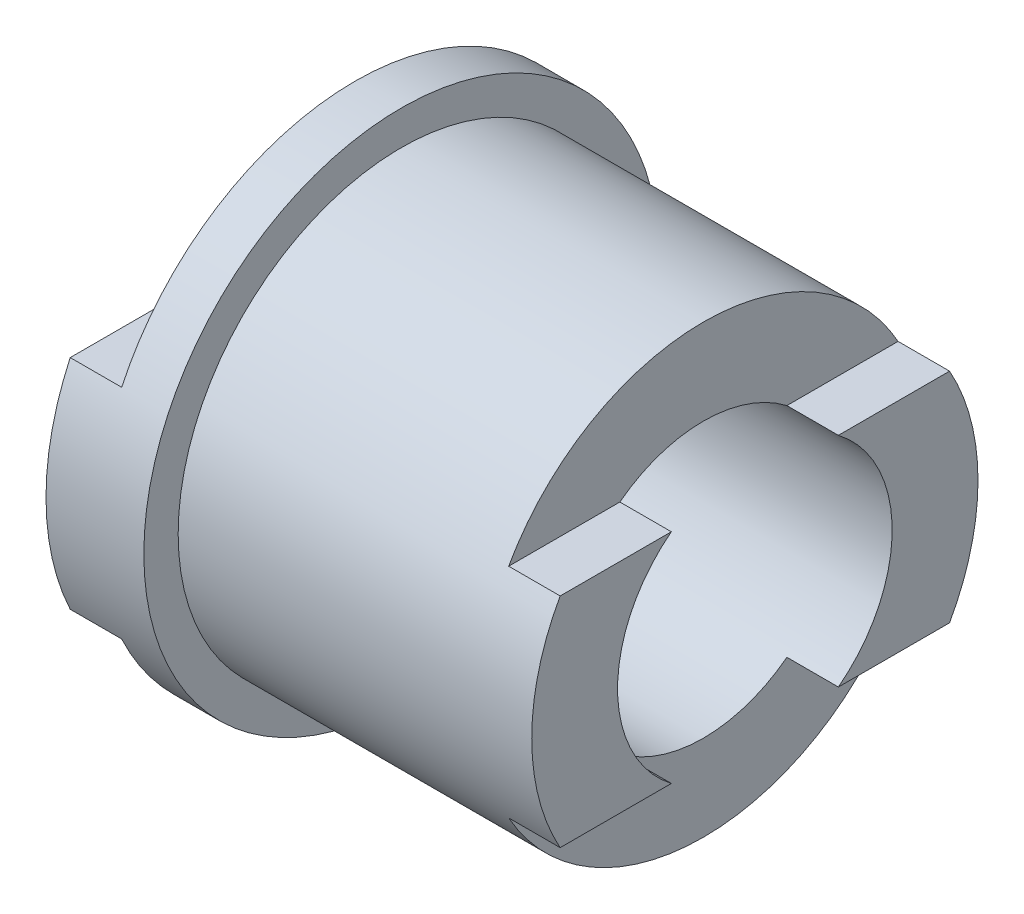
ISO-10303-21;
HEADER;
FILE_DESCRIPTION(('STEP AP214'),'2;1');
FILE_NAME('part.step','',(''),(''),'','','');
FILE_SCHEMA(('AUTOMOTIVE_DESIGN { 1 0 10303 214 1 1 1 1 }'));
ENDSEC;
DATA;
#1=APPLICATION_CONTEXT('core data for automotive mechanical design processes');
#2=APPLICATION_PROTOCOL_DEFINITION('international standard','automotive_design',2000,#1);
#3=PRODUCT_CONTEXT('',#1,'mechanical');
#4=PRODUCT('Part','Part','',(#3));
#5=PRODUCT_RELATED_PRODUCT_CATEGORY('part','',(#4));
#6=PRODUCT_DEFINITION_FORMATION('','',#4);
#7=PRODUCT_DEFINITION_CONTEXT('part definition',#1,'design');
#8=PRODUCT_DEFINITION('design','',#6,#7);
#9=PRODUCT_DEFINITION_SHAPE('','',#8);
#10=(LENGTH_UNIT() NAMED_UNIT(*) SI_UNIT(.MILLI.,.METRE.));
#11=(NAMED_UNIT(*) PLANE_ANGLE_UNIT() SI_UNIT($,.RADIAN.));
#12=(NAMED_UNIT(*) SI_UNIT($,.STERADIAN.) SOLID_ANGLE_UNIT());
#13=UNCERTAINTY_MEASURE_WITH_UNIT(LENGTH_MEASURE(1.E-05),#10,'distance_accuracy_value','');
#14=(GEOMETRIC_REPRESENTATION_CONTEXT(3) GLOBAL_UNCERTAINTY_ASSIGNED_CONTEXT((#13)) GLOBAL_UNIT_ASSIGNED_CONTEXT((#10,
#11,#12)) REPRESENTATION_CONTEXT('',''));
#15=CARTESIAN_POINT('',(0.,0.,0.));
#16=DIRECTION('',(0.,0.,1.));
#17=DIRECTION('',(1.,0.,0.));
#18=AXIS2_PLACEMENT_3D('',#15,#16,#17);
#19=CARTESIAN_POINT('',(-7.,7.5,0.));
#20=DIRECTION('',(1.,0.,0.));
#21=DIRECTION('',(0.,0.,-1.));
#22=AXIS2_PLACEMENT_3D('',#19,#20,#21);
#23=PLANE('',#22);
#24=CARTESIAN_POINT('',(-7.,0.,0.));
#25=DIRECTION('',(-1.,0.,0.));
#26=DIRECTION('',(0.,0.,1.));
#27=AXIS2_PLACEMENT_3D('',#24,#25,#26);
#28=CIRCLE('',#27,7.5);
#29=CARTESIAN_POINT('',(-7.,3.175,-6.79480500088119));
#30=VERTEX_POINT('',#29);
#31=CARTESIAN_POINT('',(-7.,-3.175,-6.79480500088119));
#32=VERTEX_POINT('',#31);
#33=EDGE_CURVE('E210',#30,#32,#28,.T.);
#34=ORIENTED_EDGE('',*,*,#33,.T.);
#35=DIRECTION('',(0.,0.,1.));
#36=VECTOR('',#35,1.);
#37=CARTESIAN_POINT('',(-7.,-3.175,-27.));
#38=LINE('',#37,#36);
#39=CARTESIAN_POINT('',(-7.,-3.175,-2.43297657202036));
#40=VERTEX_POINT('',#39);
#41=EDGE_CURVE('E286',#32,#40,#38,.T.);
#42=ORIENTED_EDGE('',*,*,#41,.T.);
#43=CARTESIAN_POINT('',(-7.,0.,0.));
#44=DIRECTION('',(-1.,0.,0.));
#45=DIRECTION('',(0.,0.,1.));
#46=AXIS2_PLACEMENT_3D('',#43,#44,#45);
#47=CIRCLE('',#46,4.);
#48=CARTESIAN_POINT('',(-7.,3.175,-2.43297657202036));
#49=VERTEX_POINT('',#48);
#50=EDGE_CURVE('E227',#49,#40,#47,.T.);
#51=ORIENTED_EDGE('',*,*,#50,.F.);
#52=DIRECTION('',(0.,0.,1.));
#53=VECTOR('',#52,1.);
#54=CARTESIAN_POINT('',(-7.,3.175,-27.));
#55=LINE('',#54,#53);
#56=EDGE_CURVE('E157',#30,#49,#55,.T.);
#57=ORIENTED_EDGE('',*,*,#56,.F.);
#58=EDGE_LOOP('',(#34,#42,#51,#57));
#59=FACE_BOUND('',#58,.T.);
#60=ADVANCED_FACE('F39',(#59),#23,.F.);
#61=CARTESIAN_POINT('',(6.15,6.5,0.));
#62=DIRECTION('',(-1.,0.,0.));
#63=DIRECTION('',(0.,0.,1.));
#64=AXIS2_PLACEMENT_3D('',#61,#62,#63);
#65=PLANE('',#64);
#66=CARTESIAN_POINT('',(6.15,0.,0.));
#67=DIRECTION('',(-1.,0.,0.));
#68=DIRECTION('',(0.,0.,1.));
#69=AXIS2_PLACEMENT_3D('',#66,#67,#68);
#70=CIRCLE('',#69,6.5);
#71=CARTESIAN_POINT('',(6.15,3.175,-5.67180526816639));
#72=VERTEX_POINT('',#71);
#73=CARTESIAN_POINT('',(6.15,-3.175,-5.67180526816639));
#74=VERTEX_POINT('',#73);
#75=EDGE_CURVE('E220',#72,#74,#70,.T.);
#76=ORIENTED_EDGE('',*,*,#75,.F.);
#77=DIRECTION('',(0.,0.,1.));
#78=VECTOR('',#77,1.);
#79=CARTESIAN_POINT('',(6.15,3.175,-27.));
#80=LINE('',#79,#78);
#81=CARTESIAN_POINT('',(6.15,3.175,-2.43297657202037));
#82=VERTEX_POINT('',#81);
#83=EDGE_CURVE('E264',#72,#82,#80,.T.);
#84=ORIENTED_EDGE('',*,*,#83,.T.);
#85=CARTESIAN_POINT('',(6.15,0.,0.));
#86=DIRECTION('',(-1.,0.,0.));
#87=DIRECTION('',(0.,0.,1.));
#88=AXIS2_PLACEMENT_3D('',#85,#86,#87);
#89=CIRCLE('',#88,4.);
#90=CARTESIAN_POINT('',(6.15,-3.175,-2.43297657202037));
#91=VERTEX_POINT('',#90);
#92=EDGE_CURVE('E224',#82,#91,#89,.T.);
#93=ORIENTED_EDGE('',*,*,#92,.T.);
#94=DIRECTION('',(0.,0.,1.));
#95=VECTOR('',#94,1.);
#96=CARTESIAN_POINT('',(6.15,-3.175,-27.));
#97=LINE('',#96,#95);
#98=EDGE_CURVE('E266',#74,#91,#97,.T.);
#99=ORIENTED_EDGE('',*,*,#98,.F.);
#100=EDGE_LOOP('',(#76,#84,#93,#99));
#101=FACE_BOUND('',#100,.T.);
#102=ADVANCED_FACE('F262',(#101),#65,.F.);
#103=CARTESIAN_POINT('',(-7.,-3.175,2.43297657202036));
#104=VERTEX_POINT('',#103);
#105=CARTESIAN_POINT('',(-7.,3.175,2.43297657202036));
#106=VERTEX_POINT('',#105);
#107=EDGE_CURVE('E225',#104,#106,#47,.T.);
#108=ORIENTED_EDGE('',*,*,#107,.F.);
#109=CARTESIAN_POINT('',(-7.,-3.175,6.79480500088118));
#110=VERTEX_POINT('',#109);
#111=EDGE_CURVE('E287',#104,#110,#38,.T.);
#112=ORIENTED_EDGE('',*,*,#111,.T.);
#113=CARTESIAN_POINT('',(-7.,3.175,6.79480500088118));
#114=VERTEX_POINT('',#113);
#115=EDGE_CURVE('E207',#110,#114,#28,.T.);
#116=ORIENTED_EDGE('',*,*,#115,.T.);
#117=EDGE_CURVE('E268',#106,#114,#55,.T.);
#118=ORIENTED_EDGE('',*,*,#117,.F.);
#119=EDGE_LOOP('',(#108,#112,#116,#118));
#120=FACE_BOUND('',#119,.T.);
#121=ADVANCED_FACE('F41',(#120),#23,.F.);
#122=CARTESIAN_POINT('',(-22.0709534368071,0.,0.));
#123=DIRECTION('',(-1.,0.,0.));
#124=DIRECTION('',(0.,0.,1.));
#125=AXIS2_PLACEMENT_3D('',#122,#123,#124);
#126=CYLINDRICAL_SURFACE('',#125,4.);
#127=ORIENTED_EDGE('',*,*,#50,.T.);
#128=DIRECTION('',(-1.,0.,0.));
#129=VECTOR('',#128,1.);
#130=CARTESIAN_POINT('',(-22.0709534368071,-3.175,-2.43297657202037));
#131=LINE('',#130,#129);
#132=CARTESIAN_POINT('',(-5.5,-3.175,-2.43297657202037));
#133=VERTEX_POINT('',#132);
#134=EDGE_CURVE('E186',#40,#133,#131,.F.);
#135=ORIENTED_EDGE('',*,*,#134,.T.);
#136=CARTESIAN_POINT('',(-5.5,0.,0.));
#137=DIRECTION('',(1.,0.,0.));
#138=DIRECTION('',(0.,0.,-1.));
#139=AXIS2_PLACEMENT_3D('',#136,#137,#138);
#140=CIRCLE('',#139,4.);
#141=CARTESIAN_POINT('',(-5.5,-3.175,2.43297657202037));
#142=VERTEX_POINT('',#141);
#143=EDGE_CURVE('E177',#133,#142,#140,.F.);
#144=ORIENTED_EDGE('',*,*,#143,.T.);
#145=DIRECTION('',(-1.,0.,0.));
#146=VECTOR('',#145,1.);
#147=CARTESIAN_POINT('',(-22.0709534368071,-3.175,2.43297657202037));
#148=LINE('',#147,#146);
#149=EDGE_CURVE('E180',#142,#104,#148,.T.);
#150=ORIENTED_EDGE('',*,*,#149,.T.);
#151=ORIENTED_EDGE('',*,*,#107,.T.);
#152=DIRECTION('',(-1.,0.,0.));
#153=VECTOR('',#152,1.);
#154=CARTESIAN_POINT('',(-22.0709534368071,3.175,2.43297657202037));
#155=LINE('',#154,#153);
#156=CARTESIAN_POINT('',(-5.5,3.175,2.43297657202036));
#157=VERTEX_POINT('',#156);
#158=EDGE_CURVE('E162',#106,#157,#155,.F.);
#159=ORIENTED_EDGE('',*,*,#158,.T.);
#160=CARTESIAN_POINT('',(-5.5,0.,0.));
#161=DIRECTION('',(1.,0.,0.));
#162=DIRECTION('',(0.,0.,-1.));
#163=AXIS2_PLACEMENT_3D('',#160,#161,#162);
#164=CIRCLE('',#163,4.);
#165=CARTESIAN_POINT('',(-5.5,3.175,-2.43297657202036));
#166=VERTEX_POINT('',#165);
#167=EDGE_CURVE('E167',#157,#166,#164,.F.);
#168=ORIENTED_EDGE('',*,*,#167,.T.);
#169=DIRECTION('',(-1.,0.,0.));
#170=VECTOR('',#169,1.);
#171=CARTESIAN_POINT('',(-22.0709534368071,3.175,-2.43297657202037));
#172=LINE('',#171,#170);
#173=EDGE_CURVE('E151',#166,#49,#172,.T.);
#174=ORIENTED_EDGE('',*,*,#173,.T.);
#175=EDGE_LOOP('',(#127,#135,#144,#150,#151,#159,#168,#174));
#176=FACE_BOUND('',#175,.T.);
#177=CARTESIAN_POINT('',(4.65,0.,0.));
#178=DIRECTION('',(-1.,0.,0.));
#179=DIRECTION('',(0.,0.,1.));
#180=AXIS2_PLACEMENT_3D('',#177,#178,#179);
#181=CIRCLE('',#180,4.);
#182=CARTESIAN_POINT('',(4.65,3.175,-2.43297657202037));
#183=VERTEX_POINT('',#182);
#184=CARTESIAN_POINT('',(4.65,3.175,2.43297657202037));
#185=VERTEX_POINT('',#184);
#186=EDGE_CURVE('E198',#183,#185,#181,.F.);
#187=ORIENTED_EDGE('',*,*,#186,.T.);
#188=DIRECTION('',(-1.,0.,0.));
#189=VECTOR('',#188,1.);
#190=CARTESIAN_POINT('',(-22.0709534368071,3.17499999999999,2.43297657202038));
#191=LINE('',#190,#189);
#192=CARTESIAN_POINT('',(6.15,3.175,2.43297657202037));
#193=VERTEX_POINT('',#192);
#194=EDGE_CURVE('E204',#185,#193,#191,.F.);
#195=ORIENTED_EDGE('',*,*,#194,.T.);
#196=CARTESIAN_POINT('',(6.15,-3.175,2.43297657202037));
#197=VERTEX_POINT('',#196);
#198=EDGE_CURVE('E221',#197,#193,#89,.T.);
#199=ORIENTED_EDGE('',*,*,#198,.F.);
#200=DIRECTION('',(-1.,0.,0.));
#201=VECTOR('',#200,1.);
#202=CARTESIAN_POINT('',(-22.0709534368071,-3.17499999999999,2.43297657202038));
#203=LINE('',#202,#201);
#204=CARTESIAN_POINT('',(4.65,-3.175,2.43297657202038));
#205=VERTEX_POINT('',#204);
#206=EDGE_CURVE('E189',#197,#205,#203,.T.);
#207=ORIENTED_EDGE('',*,*,#206,.T.);
#208=CARTESIAN_POINT('',(4.65,0.,0.));
#209=DIRECTION('',(-1.,0.,0.));
#210=DIRECTION('',(0.,0.,1.));
#211=AXIS2_PLACEMENT_3D('',#208,#209,#210);
#212=CIRCLE('',#211,4.);
#213=CARTESIAN_POINT('',(4.65,-3.175,-2.43297657202038));
#214=VERTEX_POINT('',#213);
#215=EDGE_CURVE('E195',#205,#214,#212,.F.);
#216=ORIENTED_EDGE('',*,*,#215,.T.);
#217=DIRECTION('',(-1.,0.,0.));
#218=VECTOR('',#217,1.);
#219=CARTESIAN_POINT('',(-22.0709534368071,-3.17499999999999,-2.43297657202038));
#220=LINE('',#219,#218);
#221=EDGE_CURVE('E192',#214,#91,#220,.F.);
#222=ORIENTED_EDGE('',*,*,#221,.T.);
#223=ORIENTED_EDGE('',*,*,#92,.F.);
#224=DIRECTION('',(-1.,0.,0.));
#225=VECTOR('',#224,1.);
#226=CARTESIAN_POINT('',(-22.0709534368071,3.17499999999999,-2.43297657202038));
#227=LINE('',#226,#225);
#228=EDGE_CURVE('E201',#82,#183,#227,.T.);
#229=ORIENTED_EDGE('',*,*,#228,.T.);
#230=EDGE_LOOP('',(#187,#195,#199,#207,#216,#222,#223,#229));
#231=FACE_BOUND('',#230,.T.);
#232=ADVANCED_FACE('F174',(#176,#231),#126,.F.);
#233=ORIENTED_EDGE('',*,*,#198,.T.);
#234=CARTESIAN_POINT('',(6.15,3.175,5.67180526816639));
#235=VERTEX_POINT('',#234);
#236=EDGE_CURVE('E279',#193,#235,#80,.T.);
#237=ORIENTED_EDGE('',*,*,#236,.T.);
#238=CARTESIAN_POINT('',(6.15,-3.175,5.67180526816639));
#239=VERTEX_POINT('',#238);
#240=EDGE_CURVE('E217',#239,#235,#70,.T.);
#241=ORIENTED_EDGE('',*,*,#240,.F.);
#242=EDGE_CURVE('E62',#197,#239,#97,.T.);
#243=ORIENTED_EDGE('',*,*,#242,.F.);
#244=EDGE_LOOP('',(#233,#237,#241,#243));
#245=FACE_BOUND('',#244,.T.);
#246=ADVANCED_FACE('F318',(#245),#65,.F.);
#247=CARTESIAN_POINT('',(-22.0709534368071,0.,0.));
#248=DIRECTION('',(-1.,0.,0.));
#249=DIRECTION('',(0.,0.,1.));
#250=AXIS2_PLACEMENT_3D('',#247,#248,#249);
#251=CYLINDRICAL_SURFACE('',#250,6.5);
#252=CARTESIAN_POINT('',(-4.15,0.,0.));
#253=DIRECTION('',(-1.,0.,0.));
#254=DIRECTION('',(0.,0.,1.));
#255=AXIS2_PLACEMENT_3D('',#252,#253,#254);
#256=CIRCLE('',#255,6.5);
#257=CARTESIAN_POINT('',(-4.15,0.,6.5));
#258=VERTEX_POINT('',#257);
#259=EDGE_CURVE('E214',#258,#258,#256,.T.);
#260=ORIENTED_EDGE('',*,*,#259,.F.);
#261=EDGE_LOOP('',(#260));
#262=FACE_BOUND('',#261,.T.);
#263=ORIENTED_EDGE('',*,*,#240,.T.);
#264=DIRECTION('',(-1.,0.,0.));
#265=VECTOR('',#264,1.);
#266=CARTESIAN_POINT('',(-22.0709534368071,3.17499999999999,5.67180526816639));
#267=LINE('',#266,#265);
#268=CARTESIAN_POINT('',(4.65,3.175,5.67180526816639));
#269=VERTEX_POINT('',#268);
#270=EDGE_CURVE('E11',#235,#269,#267,.T.);
#271=ORIENTED_EDGE('',*,*,#270,.T.);
#272=CARTESIAN_POINT('',(4.65,0.,0.));
#273=DIRECTION('',(-1.,0.,0.));
#274=DIRECTION('',(0.,0.,1.));
#275=AXIS2_PLACEMENT_3D('',#272,#273,#274);
#276=CIRCLE('',#275,6.5);
#277=CARTESIAN_POINT('',(4.65,3.175,-5.67180526816639));
#278=VERTEX_POINT('',#277);
#279=EDGE_CURVE('E251',#269,#278,#276,.T.);
#280=ORIENTED_EDGE('',*,*,#279,.T.);
#281=DIRECTION('',(-1.,0.,0.));
#282=VECTOR('',#281,1.);
#283=CARTESIAN_POINT('',(-22.0709534368071,3.17499999999999,-5.67180526816639));
#284=LINE('',#283,#282);
#285=EDGE_CURVE('E47',#278,#72,#284,.F.);
#286=ORIENTED_EDGE('',*,*,#285,.T.);
#287=ORIENTED_EDGE('',*,*,#75,.T.);
#288=DIRECTION('',(-1.,0.,0.));
#289=VECTOR('',#288,1.);
#290=CARTESIAN_POINT('',(-22.0709534368071,-3.17499999999999,-5.67180526816639));
#291=LINE('',#290,#289);
#292=CARTESIAN_POINT('',(4.65,-3.175,-5.67180526816639));
#293=VERTEX_POINT('',#292);
#294=EDGE_CURVE('E248',#74,#293,#291,.T.);
#295=ORIENTED_EDGE('',*,*,#294,.T.);
#296=CARTESIAN_POINT('',(4.65,0.,0.));
#297=DIRECTION('',(-1.,0.,0.));
#298=DIRECTION('',(0.,0.,1.));
#299=AXIS2_PLACEMENT_3D('',#296,#297,#298);
#300=CIRCLE('',#299,6.5);
#301=CARTESIAN_POINT('',(4.65,-3.175,5.67180526816639));
#302=VERTEX_POINT('',#301);
#303=EDGE_CURVE('E245',#293,#302,#300,.T.);
#304=ORIENTED_EDGE('',*,*,#303,.T.);
#305=DIRECTION('',(-1.,0.,0.));
#306=VECTOR('',#305,1.);
#307=CARTESIAN_POINT('',(-22.0709534368071,-3.17499999999999,5.67180526816639));
#308=LINE('',#307,#306);
#309=EDGE_CURVE('E243',#302,#239,#308,.F.);
#310=ORIENTED_EDGE('',*,*,#309,.T.);
#311=EDGE_LOOP('',(#263,#271,#280,#286,#287,#295,#304,#310));
#312=FACE_BOUND('',#311,.T.);
#313=ADVANCED_FACE('F257',(#262,#312),#251,.T.);
#314=CARTESIAN_POINT('',(-4.15,6.5,0.));
#315=DIRECTION('',(-1.,0.,0.));
#316=DIRECTION('',(0.,0.,1.));
#317=AXIS2_PLACEMENT_3D('',#314,#315,#316);
#318=PLANE('',#317);
#319=CARTESIAN_POINT('',(-4.15,0.,0.));
#320=DIRECTION('',(-1.,0.,0.));
#321=DIRECTION('',(0.,0.,1.));
#322=AXIS2_PLACEMENT_3D('',#319,#320,#321);
#323=CIRCLE('',#322,7.5);
#324=CARTESIAN_POINT('',(-4.15,0.,7.5));
#325=VERTEX_POINT('',#324);
#326=EDGE_CURVE('E211',#325,#325,#323,.T.);
#327=ORIENTED_EDGE('',*,*,#326,.F.);
#328=EDGE_LOOP('',(#327));
#329=FACE_BOUND('',#328,.T.);
#330=ORIENTED_EDGE('',*,*,#259,.T.);
#331=EDGE_LOOP('',(#330));
#332=FACE_BOUND('',#331,.T.);
#333=ADVANCED_FACE('F332',(#329,#332),#318,.F.);
#334=CARTESIAN_POINT('',(-22.0709534368071,0.,0.));
#335=DIRECTION('',(-1.,0.,0.));
#336=DIRECTION('',(0.,0.,1.));
#337=AXIS2_PLACEMENT_3D('',#334,#335,#336);
#338=CYLINDRICAL_SURFACE('',#337,7.5);
#339=CARTESIAN_POINT('',(-5.5,0.,0.));
#340=DIRECTION('',(1.,0.,0.));
#341=DIRECTION('',(0.,0.,-1.));
#342=AXIS2_PLACEMENT_3D('',#339,#340,#341);
#343=CIRCLE('',#342,7.5);
#344=CARTESIAN_POINT('',(-5.5,-3.175,6.79480500088119));
#345=VERTEX_POINT('',#344);
#346=CARTESIAN_POINT('',(-5.5,-3.175,-6.79480500088119));
#347=VERTEX_POINT('',#346);
#348=EDGE_CURVE('E234',#345,#347,#343,.T.);
#349=ORIENTED_EDGE('',*,*,#348,.T.);
#350=DIRECTION('',(-1.,0.,0.));
#351=VECTOR('',#350,1.);
#352=CARTESIAN_POINT('',(-22.0709534368071,-3.175,-6.79480500088119));
#353=LINE('',#352,#351);
#354=EDGE_CURVE('E240',#347,#32,#353,.T.);
#355=ORIENTED_EDGE('',*,*,#354,.T.);
#356=ORIENTED_EDGE('',*,*,#33,.F.);
#357=DIRECTION('',(-1.,0.,0.));
#358=VECTOR('',#357,1.);
#359=CARTESIAN_POINT('',(-22.0709534368071,3.175,-6.79480500088119));
#360=LINE('',#359,#358);
#361=CARTESIAN_POINT('',(-5.5,3.175,-6.79480500088119));
#362=VERTEX_POINT('',#361);
#363=EDGE_CURVE('E228',#30,#362,#360,.F.);
#364=ORIENTED_EDGE('',*,*,#363,.T.);
#365=CARTESIAN_POINT('',(-5.5,0.,0.));
#366=DIRECTION('',(1.,0.,0.));
#367=DIRECTION('',(0.,0.,-1.));
#368=AXIS2_PLACEMENT_3D('',#365,#366,#367);
#369=CIRCLE('',#368,7.5);
#370=CARTESIAN_POINT('',(-5.5,3.175,6.79480500088118));
#371=VERTEX_POINT('',#370);
#372=EDGE_CURVE('E169',#362,#371,#369,.T.);
#373=ORIENTED_EDGE('',*,*,#372,.T.);
#374=DIRECTION('',(-1.,0.,0.));
#375=VECTOR('',#374,1.);
#376=CARTESIAN_POINT('',(-22.0709534368071,3.175,6.79480500088119));
#377=LINE('',#376,#375);
#378=EDGE_CURVE('E231',#371,#114,#377,.T.);
#379=ORIENTED_EDGE('',*,*,#378,.T.);
#380=ORIENTED_EDGE('',*,*,#115,.F.);
#381=DIRECTION('',(-1.,0.,0.));
#382=VECTOR('',#381,1.);
#383=CARTESIAN_POINT('',(-22.0709534368071,-3.175,6.79480500088119));
#384=LINE('',#383,#382);
#385=EDGE_CURVE('E237',#110,#345,#384,.F.);
#386=ORIENTED_EDGE('',*,*,#385,.T.);
#387=EDGE_LOOP('',(#349,#355,#356,#364,#373,#379,#380,#386));
#388=FACE_BOUND('',#387,.T.);
#389=ORIENTED_EDGE('',*,*,#326,.T.);
#390=EDGE_LOOP('',(#389));
#391=FACE_BOUND('',#390,.T.);
#392=ADVANCED_FACE('F295',(#388,#391),#338,.T.);
#393=CARTESIAN_POINT('',(-5.5,7.5,-27.));
#394=DIRECTION('',(1.,0.,0.));
#395=DIRECTION('',(0.,0.,-1.));
#396=AXIS2_PLACEMENT_3D('',#393,#394,#395);
#397=PLANE('',#396);
#398=DIRECTION('',(0.,0.,1.));
#399=VECTOR('',#398,1.);
#400=CARTESIAN_POINT('',(-5.5,3.175,-27.));
#401=LINE('',#400,#399);
#402=EDGE_CURVE('E171',#157,#371,#401,.T.);
#403=ORIENTED_EDGE('',*,*,#402,.T.);
#404=ORIENTED_EDGE('',*,*,#372,.F.);
#405=EDGE_CURVE('E154',#362,#166,#401,.T.);
#406=ORIENTED_EDGE('',*,*,#405,.T.);
#407=ORIENTED_EDGE('',*,*,#167,.F.);
#408=EDGE_LOOP('',(#403,#404,#406,#407));
#409=FACE_BOUND('',#408,.T.);
#410=ADVANCED_FACE('F166',(#409),#397,.F.);
#411=CARTESIAN_POINT('',(-7.,3.175,-27.));
#412=DIRECTION('',(0.,-1.,0.));
#413=DIRECTION('',(1.,0.,0.));
#414=AXIS2_PLACEMENT_3D('',#411,#412,#413);
#415=PLANE('',#414);
#416=ORIENTED_EDGE('',*,*,#117,.T.);
#417=ORIENTED_EDGE('',*,*,#378,.F.);
#418=ORIENTED_EDGE('',*,*,#402,.F.);
#419=ORIENTED_EDGE('',*,*,#158,.F.);
#420=EDGE_LOOP('',(#416,#417,#418,#419));
#421=FACE_BOUND('',#420,.T.);
#422=ADVANCED_FACE('F291',(#421),#415,.F.);
#423=ORIENTED_EDGE('',*,*,#405,.F.);
#424=ORIENTED_EDGE('',*,*,#363,.F.);
#425=ORIENTED_EDGE('',*,*,#56,.T.);
#426=ORIENTED_EDGE('',*,*,#173,.F.);
#427=EDGE_LOOP('',(#423,#424,#425,#426));
#428=FACE_BOUND('',#427,.T.);
#429=ADVANCED_FACE('F153',(#428),#415,.F.);
#430=CARTESIAN_POINT('',(-7.,-3.175,-27.));
#431=DIRECTION('',(0.,1.,0.));
#432=DIRECTION('',(-1.,0.,0.));
#433=AXIS2_PLACEMENT_3D('',#430,#431,#432);
#434=PLANE('',#433);
#435=ORIENTED_EDGE('',*,*,#41,.F.);
#436=ORIENTED_EDGE('',*,*,#354,.F.);
#437=DIRECTION('',(0.,0.,1.));
#438=VECTOR('',#437,1.);
#439=CARTESIAN_POINT('',(-5.5,-3.175,-27.));
#440=LINE('',#439,#438);
#441=EDGE_CURVE('E282',#347,#133,#440,.T.);
#442=ORIENTED_EDGE('',*,*,#441,.T.);
#443=ORIENTED_EDGE('',*,*,#134,.F.);
#444=EDGE_LOOP('',(#435,#436,#442,#443));
#445=FACE_BOUND('',#444,.T.);
#446=ADVANCED_FACE('F307',(#445),#434,.F.);
#447=EDGE_CURVE('E283',#142,#345,#440,.T.);
#448=ORIENTED_EDGE('',*,*,#447,.T.);
#449=ORIENTED_EDGE('',*,*,#385,.F.);
#450=ORIENTED_EDGE('',*,*,#111,.F.);
#451=ORIENTED_EDGE('',*,*,#149,.F.);
#452=EDGE_LOOP('',(#448,#449,#450,#451));
#453=FACE_BOUND('',#452,.T.);
#454=ADVANCED_FACE('F300',(#453),#434,.F.);
#455=CARTESIAN_POINT('',(-5.5,-7.5,-27.));
#456=DIRECTION('',(1.,0.,0.));
#457=DIRECTION('',(0.,0.,-1.));
#458=AXIS2_PLACEMENT_3D('',#455,#456,#457);
#459=PLANE('',#458);
#460=ORIENTED_EDGE('',*,*,#441,.F.);
#461=ORIENTED_EDGE('',*,*,#348,.F.);
#462=ORIENTED_EDGE('',*,*,#447,.F.);
#463=ORIENTED_EDGE('',*,*,#143,.F.);
#464=EDGE_LOOP('',(#460,#461,#462,#463));
#465=FACE_BOUND('',#464,.T.);
#466=ADVANCED_FACE('F304',(#465),#459,.F.);
#467=CARTESIAN_POINT('',(4.65,-6.5,-27.));
#468=DIRECTION('',(-1.,0.,0.));
#469=DIRECTION('',(0.,0.,1.));
#470=AXIS2_PLACEMENT_3D('',#467,#468,#469);
#471=PLANE('',#470);
#472=DIRECTION('',(0.,0.,1.));
#473=VECTOR('',#472,1.);
#474=CARTESIAN_POINT('',(4.65,-3.175,-27.));
#475=LINE('',#474,#473);
#476=EDGE_CURVE('E273',#205,#302,#475,.T.);
#477=ORIENTED_EDGE('',*,*,#476,.T.);
#478=ORIENTED_EDGE('',*,*,#303,.F.);
#479=EDGE_CURVE('E271',#293,#214,#475,.T.);
#480=ORIENTED_EDGE('',*,*,#479,.T.);
#481=ORIENTED_EDGE('',*,*,#215,.F.);
#482=EDGE_LOOP('',(#477,#478,#480,#481));
#483=FACE_BOUND('',#482,.T.);
#484=ADVANCED_FACE('F347',(#483),#471,.F.);
#485=CARTESIAN_POINT('',(6.15,-3.175,-27.));
#486=DIRECTION('',(0.,1.,0.));
#487=DIRECTION('',(-1.,0.,0.));
#488=AXIS2_PLACEMENT_3D('',#485,#486,#487);
#489=PLANE('',#488);
#490=ORIENTED_EDGE('',*,*,#479,.F.);
#491=ORIENTED_EDGE('',*,*,#294,.F.);
#492=ORIENTED_EDGE('',*,*,#98,.T.);
#493=ORIENTED_EDGE('',*,*,#221,.F.);
#494=EDGE_LOOP('',(#490,#491,#492,#493));
#495=FACE_BOUND('',#494,.T.);
#496=ADVANCED_FACE('F359',(#495),#489,.F.);
#497=ORIENTED_EDGE('',*,*,#242,.T.);
#498=ORIENTED_EDGE('',*,*,#309,.F.);
#499=ORIENTED_EDGE('',*,*,#476,.F.);
#500=ORIENTED_EDGE('',*,*,#206,.F.);
#501=EDGE_LOOP('',(#497,#498,#499,#500));
#502=FACE_BOUND('',#501,.T.);
#503=ADVANCED_FACE('F352',(#502),#489,.F.);
#504=CARTESIAN_POINT('',(6.15,3.175,-27.));
#505=DIRECTION('',(0.,-1.,0.));
#506=DIRECTION('',(1.,0.,0.));
#507=AXIS2_PLACEMENT_3D('',#504,#505,#506);
#508=PLANE('',#507);
#509=DIRECTION('',(0.,0.,1.));
#510=VECTOR('',#509,1.);
#511=CARTESIAN_POINT('',(4.65,3.175,-27.));
#512=LINE('',#511,#510);
#513=EDGE_CURVE('E276',#185,#269,#512,.T.);
#514=ORIENTED_EDGE('',*,*,#513,.T.);
#515=ORIENTED_EDGE('',*,*,#270,.F.);
#516=ORIENTED_EDGE('',*,*,#236,.F.);
#517=ORIENTED_EDGE('',*,*,#194,.F.);
#518=EDGE_LOOP('',(#514,#515,#516,#517));
#519=FACE_BOUND('',#518,.T.);
#520=ADVANCED_FACE('F348',(#519),#508,.F.);
#521=ORIENTED_EDGE('',*,*,#83,.F.);
#522=ORIENTED_EDGE('',*,*,#285,.F.);
#523=EDGE_CURVE('E54',#278,#183,#512,.T.);
#524=ORIENTED_EDGE('',*,*,#523,.T.);
#525=ORIENTED_EDGE('',*,*,#228,.F.);
#526=EDGE_LOOP('',(#521,#522,#524,#525));
#527=FACE_BOUND('',#526,.T.);
#528=ADVANCED_FACE('F351',(#527),#508,.F.);
#529=CARTESIAN_POINT('',(4.65,6.5,-27.));
#530=DIRECTION('',(-1.,0.,0.));
#531=DIRECTION('',(0.,0.,1.));
#532=AXIS2_PLACEMENT_3D('',#529,#530,#531);
#533=PLANE('',#532);
#534=ORIENTED_EDGE('',*,*,#523,.F.);
#535=ORIENTED_EDGE('',*,*,#279,.F.);
#536=ORIENTED_EDGE('',*,*,#513,.F.);
#537=ORIENTED_EDGE('',*,*,#186,.F.);
#538=EDGE_LOOP('',(#534,#535,#536,#537));
#539=FACE_BOUND('',#538,.T.);
#540=ADVANCED_FACE('F354',(#539),#533,.F.);
#541=CLOSED_SHELL('',(#60,#102,#121,#232,#246,#313,#333,#392,#410,#422,#429,#446,#454,#466,#484,
#496,#503,#520,#528,#540));
#542=MANIFOLD_SOLID_BREP('B2',#541);
#543=ADVANCED_BREP_SHAPE_REPRESENTATION('',(#18,#542),#14);
#544=SHAPE_DEFINITION_REPRESENTATION(#9,#543);
ENDSEC;
END-ISO-10303-21;
